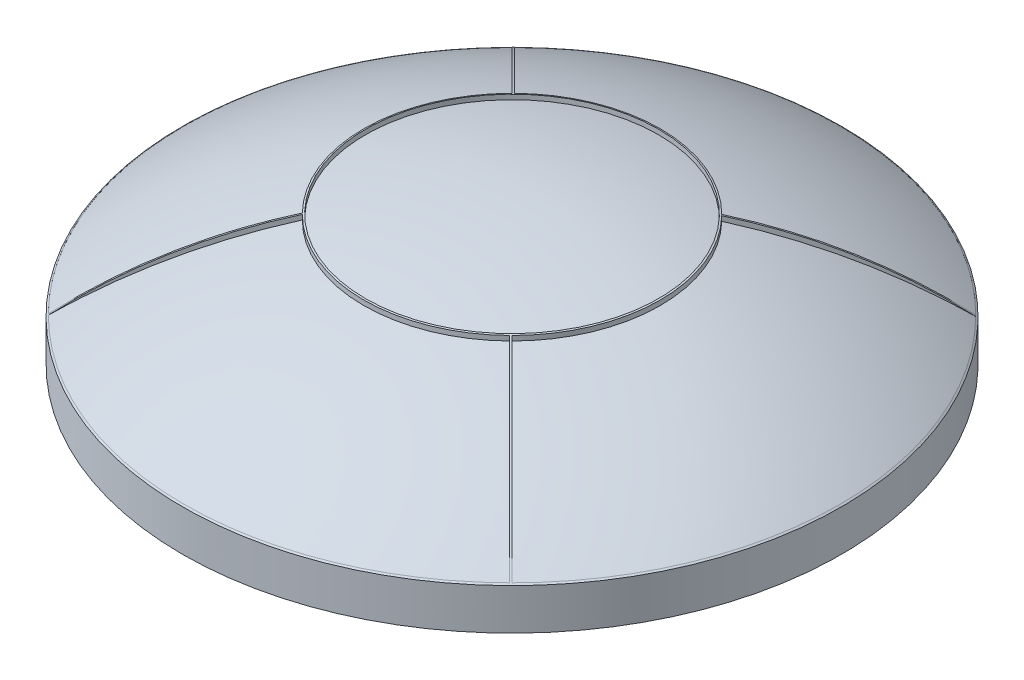
ISO-10303-21;
HEADER;
FILE_DESCRIPTION(('STEP AP214'),'2;1');
FILE_NAME('part.step','',(''),(''),'','','');
FILE_SCHEMA(('AUTOMOTIVE_DESIGN { 1 0 10303 214 1 1 1 1 }'));
ENDSEC;
DATA;
#1=APPLICATION_CONTEXT('core data for automotive mechanical design processes');
#2=APPLICATION_PROTOCOL_DEFINITION('international standard','automotive_design',2000,#1);
#3=PRODUCT_CONTEXT('',#1,'mechanical');
#4=PRODUCT('Part','Part','',(#3));
#5=PRODUCT_RELATED_PRODUCT_CATEGORY('part','',(#4));
#6=PRODUCT_DEFINITION_FORMATION('','',#4);
#7=PRODUCT_DEFINITION_CONTEXT('part definition',#1,'design');
#8=PRODUCT_DEFINITION('design','',#6,#7);
#9=PRODUCT_DEFINITION_SHAPE('','',#8);
#10=(LENGTH_UNIT() NAMED_UNIT(*) SI_UNIT(.MILLI.,.METRE.));
#11=(NAMED_UNIT(*) PLANE_ANGLE_UNIT() SI_UNIT($,.RADIAN.));
#12=(NAMED_UNIT(*) SI_UNIT($,.STERADIAN.) SOLID_ANGLE_UNIT());
#13=UNCERTAINTY_MEASURE_WITH_UNIT(LENGTH_MEASURE(1.E-05),#10,'distance_accuracy_value','');
#14=(GEOMETRIC_REPRESENTATION_CONTEXT(3) GLOBAL_UNCERTAINTY_ASSIGNED_CONTEXT((#13)) GLOBAL_UNIT_ASSIGNED_CONTEXT((#10,
#11,#12)) REPRESENTATION_CONTEXT('',''));
#15=CARTESIAN_POINT('',(0.,0.,0.));
#16=DIRECTION('',(0.,0.,1.));
#17=DIRECTION('',(1.,0.,0.));
#18=AXIS2_PLACEMENT_3D('',#15,#16,#17);
#19=CARTESIAN_POINT('',(0.,0.5,0.));
#20=DIRECTION('',(0.,-1.,0.));
#21=DIRECTION('',(0.,0.,-1.));
#22=AXIS2_PLACEMENT_3D('',#19,#20,#21);
#23=CYLINDRICAL_SURFACE('',#22,4.);
#24=CARTESIAN_POINT('',(0.,0.,0.));
#25=DIRECTION('',(0.,1.,0.));
#26=DIRECTION('',(0.,0.,1.));
#27=AXIS2_PLACEMENT_3D('',#24,#25,#26);
#28=CIRCLE('',#27,4.);
#29=CARTESIAN_POINT('',(0.,0.,4.));
#30=VERTEX_POINT('',#29);
#31=EDGE_CURVE('E234',#30,#30,#28,.T.);
#32=ORIENTED_EDGE('',*,*,#31,.T.);
#33=EDGE_LOOP('',(#32));
#34=FACE_BOUND('',#33,.T.);
#35=CARTESIAN_POINT('',(0.,0.5,0.));
#36=DIRECTION('',(0.,-1.,0.));
#37=DIRECTION('',(0.,0.,-1.));
#38=AXIS2_PLACEMENT_3D('',#35,#36,#37);
#39=CIRCLE('',#38,4.);
#40=CARTESIAN_POINT('',(0.,0.5,-4.));
#41=VERTEX_POINT('',#40);
#42=EDGE_CURVE('E174',#41,#41,#39,.T.);
#43=ORIENTED_EDGE('',*,*,#42,.T.);
#44=EDGE_LOOP('',(#43));
#45=FACE_BOUND('',#44,.T.);
#46=ADVANCED_FACE('F44',(#34,#45),#23,.T.);
#47=CARTESIAN_POINT('',(0.,0.,0.));
#48=DIRECTION('',(0.,1.,0.));
#49=DIRECTION('',(0.,0.,1.));
#50=AXIS2_PLACEMENT_3D('',#47,#48,#49);
#51=PLANE('',#50);
#52=ORIENTED_EDGE('',*,*,#31,.F.);
#53=EDGE_LOOP('',(#52));
#54=FACE_BOUND('',#53,.T.);
#55=CARTESIAN_POINT('',(0.,0.,0.));
#56=DIRECTION('',(0.,1.,0.));
#57=DIRECTION('',(0.,0.,1.));
#58=AXIS2_PLACEMENT_3D('',#55,#56,#57);
#59=CIRCLE('',#58,3.9);
#60=CARTESIAN_POINT('',(0.,0.,3.9));
#61=VERTEX_POINT('',#60);
#62=EDGE_CURVE('E229',#61,#61,#59,.T.);
#63=ORIENTED_EDGE('',*,*,#62,.T.);
#64=EDGE_LOOP('',(#63));
#65=FACE_BOUND('',#64,.T.);
#66=ADVANCED_FACE('F377',(#54,#65),#51,.F.);
#67=CARTESIAN_POINT('',(0.,0.5,0.));
#68=DIRECTION('',(0.,-1.,0.));
#69=DIRECTION('',(0.,0.,-1.));
#70=AXIS2_PLACEMENT_3D('',#67,#68,#69);
#71=CYLINDRICAL_SURFACE('',#70,3.9);
#72=CARTESIAN_POINT('',(0.,0.447379312838322,0.));
#73=DIRECTION('',(0.,-1.,0.));
#74=DIRECTION('',(0.,0.,-1.));
#75=AXIS2_PLACEMENT_3D('',#72,#73,#74);
#76=CIRCLE('',#75,3.9);
#77=CARTESIAN_POINT('',(0.,0.447379312838322,-3.9));
#78=VERTEX_POINT('',#77);
#79=EDGE_CURVE('E231',#78,#78,#76,.F.);
#80=ORIENTED_EDGE('',*,*,#79,.T.);
#81=EDGE_LOOP('',(#80));
#82=FACE_BOUND('',#81,.T.);
#83=ORIENTED_EDGE('',*,*,#62,.F.);
#84=EDGE_LOOP('',(#83));
#85=FACE_BOUND('',#84,.T.);
#86=ADVANCED_FACE('F382',(#82,#85),#71,.F.);
#87=CARTESIAN_POINT('',(0.,-5.27500000000001,0.));
#88=DIRECTION('',(0.,0.,1.));
#89=DIRECTION('',(1.,0.,0.));
#90=AXIS2_PLACEMENT_3D('',#87,#88,#89);
#91=SPHERICAL_SURFACE('',#90,6.92500000000001);
#92=CARTESIAN_POINT('',(0.,-5.27500000000001,0.));
#93=DIRECTION('',(0.,-1.,0.));
#94=DIRECTION('',(0.,0.,-1.));
#95=AXIS2_PLACEMENT_3D('',#92,#93,#94);
#96=SPHERICAL_SURFACE('',#95,6.92500000000001);
#97=ORIENTED_EDGE('',*,*,#79,.F.);
#98=EDGE_LOOP('',(#97));
#99=FACE_BOUND('',#98,.T.);
#100=ADVANCED_FACE('F317',(#99),#96,.F.);
#101=CARTESIAN_POINT('',(0.,-4.24129788820105,0.));
#102=DIRECTION('',(0.,-1.,0.));
#103=DIRECTION('',(0.,0.,-1.));
#104=AXIS2_PLACEMENT_3D('',#101,#102,#103);
#105=DEGENERATE_TOROIDAL_SURFACE('',#104,0.323031909937175,6.,.T.);
#106=CARTESIAN_POINT('',(0.,1.57911824679641,0.));
#107=DIRECTION('',(0.,-1.,0.));
#108=DIRECTION('',(0.,0.,-1.));
#109=AXIS2_PLACEMENT_3D('',#106,#107,#108);
#110=CIRCLE('',#109,1.78);
#111=CARTESIAN_POINT('',(0.,1.57911824679641,-1.78));
#112=VERTEX_POINT('',#111);
#113=EDGE_CURVE('E180',#112,#112,#110,.F.);
#114=ORIENTED_EDGE('',*,*,#113,.F.);
#115=EDGE_LOOP('',(#114));
#116=FACE_BOUND('',#115,.T.);
#117=CARTESIAN_POINT('',(0.,0.515443053689969,0.));
#118=DIRECTION('',(0.,-1.,0.));
#119=DIRECTION('',(0.,0.,-1.));
#120=AXIS2_PLACEMENT_3D('',#117,#118,#119);
#121=CIRCLE('',#120,3.98);
#122=CARTESIAN_POINT('',(2.81428498912247,0.515443053689969,2.81428498912245));
#123=VERTEX_POINT('',#122);
#124=CARTESIAN_POINT('',(2.82839159151781,0.515443053689969,-2.80010732027031));
#125=VERTEX_POINT('',#124);
#126=EDGE_CURVE('E62',#123,#125,#121,.F.);
#127=ORIENTED_EDGE('',*,*,#126,.F.);
#128=CARTESIAN_POINT('',(0.22841805405622,-4.24129788820105,0.228418054056217));
#129=DIRECTION('',(-0.707106781186544,0.,0.707106781186551));
#130=DIRECTION('',(0.707106781186551,0.,0.707106781186544));
#131=AXIS2_PLACEMENT_3D('',#128,#129,#130);
#132=CIRCLE('',#131,6.);
#133=CARTESIAN_POINT('',(1.27279220613579,1.57407529508961,1.27279220613578));
#134=VERTEX_POINT('',#133);
#135=EDGE_CURVE('E308',#123,#134,#132,.T.);
#136=ORIENTED_EDGE('',*,*,#135,.T.);
#137=CARTESIAN_POINT('',(0.,1.57407529508962,0.));
#138=DIRECTION('',(0.,-1.,0.));
#139=DIRECTION('',(0.,0.,-1.));
#140=AXIS2_PLACEMENT_3D('',#137,#138,#139);
#141=CIRCLE('',#140,1.8);
#142=CARTESIAN_POINT('',(1.28685577191432,1.57407529508962,-1.25857150066685));
#143=VERTEX_POINT('',#142);
#144=EDGE_CURVE('E412',#134,#143,#141,.F.);
#145=ORIENTED_EDGE('',*,*,#144,.T.);
#146=CARTESIAN_POINT('',(2.82859159151728,0.51522559443195,-2.80030732026979));
#147=CARTESIAN_POINT('',(2.73325329448407,0.61891786287853,-2.70496902323658));
#148=CARTESIAN_POINT('',(2.63478016523756,0.716846815742468,-2.60649589399008));
#149=CARTESIAN_POINT('',(2.43228250689038,0.900565065052887,-2.40399823564289));
#150=CARTESIAN_POINT('',(2.32825627523377,0.986350608604001,-2.29997200398628));
#151=CARTESIAN_POINT('',(2.11721718036869,1.14377145291902,-2.08893290912121));
#152=CARTESIAN_POINT('',(2.01028379459139,1.21562016420845,-1.98199952334391));
#153=CARTESIAN_POINT('',(1.79257627457968,1.34641172920624,-1.7642920033322));
#154=CARTESIAN_POINT('',(1.68180382015959,1.40536014697418,-1.65351954891212));
#155=CARTESIAN_POINT('',(1.52285605130399,1.47938197423813,-1.49457178005652));
#156=CARTESIAN_POINT('',(1.47593395622236,1.49996232703865,-1.44764968497489));
#157=CARTESIAN_POINT('',(1.38163145832746,1.53879891098853,-1.35334718707999));
#158=CARTESIAN_POINT('',(1.33425124445468,1.55705605969352,-1.3059669732072));
#159=CARTESIAN_POINT('',(1.28665577191432,1.57414711873385,-1.25837150066685));
#160=B_SPLINE_CURVE_WITH_KNOTS('',3,(#146,#147,#148,#149,#150,#151,#152,#153,#154,#155,#156,
#157,#158,#159),.UNSPECIFIED.,.F.,.F.,(4,2,2,2,2,2,4),(0.,0.510122620869838,1.02040255148244,
1.52211437286255,2.02360937122764,2.23200364459259,2.44031535492556),.UNSPECIFIED.);
#161=EDGE_CURVE('E185',#125,#143,#160,.T.);
#162=ORIENTED_EDGE('',*,*,#161,.F.);
#163=EDGE_LOOP('',(#127,#136,#145,#162));
#164=FACE_BOUND('',#163,.T.);
#165=CARTESIAN_POINT('',(0.,0.515443053689969,0.));
#166=DIRECTION('',(0.,-1.,0.));
#167=DIRECTION('',(0.,0.,-1.));
#168=AXIS2_PLACEMENT_3D('',#165,#166,#167);
#169=CIRCLE('',#168,3.98);
#170=CARTESIAN_POINT('',(-2.81428498912247,0.51544305368997,2.81428498912244));
#171=VERTEX_POINT('',#170);
#172=CARTESIAN_POINT('',(2.80010732027034,0.515443053689969,2.82839159151778));
#173=VERTEX_POINT('',#172);
#174=EDGE_CURVE('E297',#171,#173,#169,.F.);
#175=ORIENTED_EDGE('',*,*,#174,.F.);
#176=CARTESIAN_POINT('',(-0.22841805405622,-4.24129788820105,0.228418054056217));
#177=DIRECTION('',(-0.707106781186544,0.,-0.707106781186551));
#178=DIRECTION('',(-0.707106781186551,0.,0.707106781186544));
#179=AXIS2_PLACEMENT_3D('',#176,#177,#178);
#180=CIRCLE('',#179,6.);
#181=CARTESIAN_POINT('',(-1.27279220613579,1.57407529508961,1.27279220613578));
#182=VERTEX_POINT('',#181);
#183=EDGE_CURVE('E287',#171,#182,#180,.T.);
#184=ORIENTED_EDGE('',*,*,#183,.T.);
#185=CARTESIAN_POINT('',(0.,1.57407529508962,0.));
#186=DIRECTION('',(0.,-1.,0.));
#187=DIRECTION('',(0.,0.,-1.));
#188=AXIS2_PLACEMENT_3D('',#185,#186,#187);
#189=CIRCLE('',#188,1.8);
#190=CARTESIAN_POINT('',(1.25857150066686,1.57407529508962,1.28685577191431));
#191=VERTEX_POINT('',#190);
#192=EDGE_CURVE('E290',#182,#191,#189,.F.);
#193=ORIENTED_EDGE('',*,*,#192,.T.);
#194=CARTESIAN_POINT('',(2.80030732026982,0.515225594431952,2.82859159151725));
#195=CARTESIAN_POINT('',(2.70496902323661,0.618917862878531,2.73325329448404));
#196=CARTESIAN_POINT('',(2.6064958939901,0.716846815742469,2.63478016523754));
#197=CARTESIAN_POINT('',(2.40399823564292,0.900565065052888,2.43228250689035));
#198=CARTESIAN_POINT('',(2.2999720039863,0.986350608604002,2.32825627523374));
#199=CARTESIAN_POINT('',(2.08893290912123,1.14377145291902,2.11721718036867));
#200=CARTESIAN_POINT('',(1.98199952334393,1.21562016420846,2.01028379459137));
#201=CARTESIAN_POINT('',(1.76429200333221,1.34641172920624,1.79257627457966));
#202=CARTESIAN_POINT('',(1.65351954891213,1.40536014697418,1.68180382015957));
#203=CARTESIAN_POINT('',(1.49457178005653,1.47938197423813,1.52285605130398));
#204=CARTESIAN_POINT('',(1.4476496849749,1.49996232703865,1.47593395622235));
#205=CARTESIAN_POINT('',(1.35334718708,1.53879891098853,1.38163145832745));
#206=CARTESIAN_POINT('',(1.30596697320722,1.55705605969352,1.33425124445466));
#207=CARTESIAN_POINT('',(1.25837150066686,1.57414711873385,1.28665577191431));
#208=B_SPLINE_CURVE_WITH_KNOTS('',3,(#194,#195,#196,#197,#198,#199,#200,#201,#202,#203,#204,
#205,#206,#207),.UNSPECIFIED.,.F.,.F.,(4,2,2,2,2,2,4),(0.,0.510122620869838,1.02040255148244,
1.52211437286255,2.02360937122765,2.23200364459259,2.44031535492555),.UNSPECIFIED.);
#209=EDGE_CURVE('E300',#173,#191,#208,.T.);
#210=ORIENTED_EDGE('',*,*,#209,.F.);
#211=EDGE_LOOP('',(#175,#184,#193,#210));
#212=FACE_BOUND('',#211,.T.);
#213=ORIENTED_EDGE('',*,*,#42,.F.);
#214=EDGE_LOOP('',(#213));
#215=FACE_BOUND('',#214,.T.);
#216=CARTESIAN_POINT('',(0.,0.515443053689969,0.));
#217=DIRECTION('',(0.,-1.,0.));
#218=DIRECTION('',(0.,0.,-1.));
#219=AXIS2_PLACEMENT_3D('',#216,#217,#218);
#220=CIRCLE('',#219,3.98);
#221=CARTESIAN_POINT('',(-2.81428498912248,0.515443053689969,-2.81428498912244));
#222=VERTEX_POINT('',#221);
#223=CARTESIAN_POINT('',(-2.82839159151781,0.515443053689969,2.80010732027031));
#224=VERTEX_POINT('',#223);
#225=EDGE_CURVE('E161',#222,#224,#220,.F.);
#226=ORIENTED_EDGE('',*,*,#225,.F.);
#227=CARTESIAN_POINT('',(-0.22841805405622,-4.24129788820105,-0.228418054056217));
#228=DIRECTION('',(0.707106781186543,0.,-0.707106781186552));
#229=DIRECTION('',(-0.707106781186552,0.,-0.707106781186543));
#230=AXIS2_PLACEMENT_3D('',#227,#228,#229);
#231=CIRCLE('',#230,6.);
#232=CARTESIAN_POINT('',(-1.27279220613579,1.57407529508961,-1.27279220613578));
#233=VERTEX_POINT('',#232);
#234=EDGE_CURVE('E13',#222,#233,#231,.T.);
#235=ORIENTED_EDGE('',*,*,#234,.T.);
#236=CARTESIAN_POINT('',(0.,1.57407529508962,0.));
#237=DIRECTION('',(0.,-1.,0.));
#238=DIRECTION('',(0.,0.,-1.));
#239=AXIS2_PLACEMENT_3D('',#236,#237,#238);
#240=CIRCLE('',#239,1.8);
#241=CARTESIAN_POINT('',(-1.28685577191432,1.57407529508962,1.25857150066685));
#242=VERTEX_POINT('',#241);
#243=EDGE_CURVE('E158',#233,#242,#240,.F.);
#244=ORIENTED_EDGE('',*,*,#243,.T.);
#245=CARTESIAN_POINT('',(-2.82859159151728,0.51522559443195,2.80030732026979));
#246=CARTESIAN_POINT('',(-2.73325329448407,0.618917862878529,2.70496902323658));
#247=CARTESIAN_POINT('',(-2.63478016523757,0.716846815742467,2.60649589399008));
#248=CARTESIAN_POINT('',(-2.43228250689038,0.900565065052886,2.40399823564289));
#249=CARTESIAN_POINT('',(-2.32825627523377,0.986350608604,2.29997200398628));
#250=CARTESIAN_POINT('',(-2.1172171803687,1.14377145291902,2.08893290912121));
#251=CARTESIAN_POINT('',(-2.01028379459139,1.21562016420845,1.98199952334391));
#252=CARTESIAN_POINT('',(-1.79257627457968,1.34641172920624,1.7642920033322));
#253=CARTESIAN_POINT('',(-1.68180382015959,1.40536014697418,1.65351954891211));
#254=CARTESIAN_POINT('',(-1.52285605130399,1.47938197423813,1.49457178005651));
#255=CARTESIAN_POINT('',(-1.47593395622236,1.49996232703865,1.44764968497488));
#256=CARTESIAN_POINT('',(-1.38163145832746,1.53879891098853,1.35334718707998));
#257=CARTESIAN_POINT('',(-1.33425124445468,1.55705605969352,1.3059669732072));
#258=CARTESIAN_POINT('',(-1.28665577191432,1.57414711873385,1.25837150066684));
#259=B_SPLINE_CURVE_WITH_KNOTS('',3,(#245,#246,#247,#248,#249,#250,#251,#252,#253,#254,#255,
#256,#257,#258),.UNSPECIFIED.,.F.,.F.,(4,2,2,2,2,2,4),(0.,0.510122620869838,1.02040255148244,
1.52211437286255,2.02360937122764,2.23200364459259,2.44031535492556),.UNSPECIFIED.);
#260=EDGE_CURVE('E325',#224,#242,#259,.T.);
#261=ORIENTED_EDGE('',*,*,#260,.F.);
#262=EDGE_LOOP('',(#226,#235,#244,#261));
#263=FACE_BOUND('',#262,.T.);
#264=CARTESIAN_POINT('',(0.22841805405622,-4.24129788820105,-0.228418054056217));
#265=DIRECTION('',(0.707106781186544,0.,0.707106781186551));
#266=DIRECTION('',(0.707106781186551,0.,-0.707106781186544));
#267=AXIS2_PLACEMENT_3D('',#264,#265,#266);
#268=CIRCLE('',#267,6.);
#269=CARTESIAN_POINT('',(2.81428498912248,0.515443053689969,-2.81428498912245));
#270=VERTEX_POINT('',#269);
#271=CARTESIAN_POINT('',(1.27279220613579,1.57407529508962,-1.27279220613578));
#272=VERTEX_POINT('',#271);
#273=EDGE_CURVE('E285',#270,#272,#268,.T.);
#274=ORIENTED_EDGE('',*,*,#273,.T.);
#275=CARTESIAN_POINT('',(0.,1.57407529508962,0.));
#276=DIRECTION('',(0.,-1.,0.));
#277=DIRECTION('',(0.,0.,-1.));
#278=AXIS2_PLACEMENT_3D('',#275,#276,#277);
#279=CIRCLE('',#278,1.8);
#280=CARTESIAN_POINT('',(-1.25857150066686,1.57407529509593,-1.28685577191431));
#281=VERTEX_POINT('',#280);
#282=EDGE_CURVE('E292',#272,#281,#279,.F.);
#283=ORIENTED_EDGE('',*,*,#282,.T.);
#284=CARTESIAN_POINT('',(-2.80030732026982,0.515225594431952,-2.82859159151725));
#285=CARTESIAN_POINT('',(-2.70496902323661,0.618917862878531,-2.73325329448404));
#286=CARTESIAN_POINT('',(-2.6064958939901,0.716846815742469,-2.63478016523754));
#287=CARTESIAN_POINT('',(-2.40399823564292,0.900565065052887,-2.43228250689035));
#288=CARTESIAN_POINT('',(-2.2999720039863,0.986350608604001,-2.32825627523374));
#289=CARTESIAN_POINT('',(-2.08893290912123,1.14377145291902,-2.11721718036867));
#290=CARTESIAN_POINT('',(-1.98199952334393,1.21562016420845,-2.01028379459137));
#291=CARTESIAN_POINT('',(-1.76429200333221,1.34641172920624,-1.79257627457966));
#292=CARTESIAN_POINT('',(-1.65351954891213,1.40536014697418,-1.68180382015957));
#293=CARTESIAN_POINT('',(-1.49457178005653,1.47938197423813,-1.52285605130398));
#294=CARTESIAN_POINT('',(-1.4476496849749,1.49996232703865,-1.47593395622235));
#295=CARTESIAN_POINT('',(-1.35334718708,1.53879891098853,-1.38163145832745));
#296=CARTESIAN_POINT('',(-1.30596697320722,1.55705605969352,-1.33425124445466));
#297=CARTESIAN_POINT('',(-1.25837150066686,1.57414711873385,-1.28665577191431));
#298=B_SPLINE_CURVE_WITH_KNOTS('',3,(#284,#285,#286,#287,#288,#289,#290,#291,#292,#293,#294,
#295,#296,#297),.UNSPECIFIED.,.F.,.F.,(4,2,2,2,2,2,4),(0.,0.510122620869838,1.02040255148243,
1.52211437286255,2.02360937122764,2.23200364459259,2.44031535492555),.UNSPECIFIED.);
#299=CARTESIAN_POINT('',(-2.80010732027033,0.515443053689987,-2.82839159151776));
#300=VERTEX_POINT('',#299);
#301=EDGE_CURVE('E333',#300,#281,#298,.T.);
#302=ORIENTED_EDGE('',*,*,#301,.F.);
#303=CARTESIAN_POINT('',(0.,0.515443053689969,0.));
#304=DIRECTION('',(0.,-1.,0.));
#305=DIRECTION('',(0.,0.,-1.));
#306=AXIS2_PLACEMENT_3D('',#303,#304,#305);
#307=CIRCLE('',#306,3.98);
#308=EDGE_CURVE('E288',#270,#300,#307,.F.);
#309=ORIENTED_EDGE('',*,*,#308,.F.);
#310=EDGE_LOOP('',(#274,#283,#302,#309));
#311=FACE_BOUND('',#310,.T.);
#312=ADVANCED_FACE('F156',(#116,#164,#212,#215,#263,#311),#105,.T.);
#313=CARTESIAN_POINT('',(0.,-5.27500000000001,0.));
#314=DIRECTION('',(0.,0.,1.));
#315=DIRECTION('',(1.,0.,0.));
#316=AXIS2_PLACEMENT_3D('',#313,#314,#315);
#317=SPHERICAL_SURFACE('',#316,7.02500000000001);
#318=CARTESIAN_POINT('',(0.,0.513801689469074,0.));
#319=DIRECTION('',(0.,-1.,0.));
#320=DIRECTION('',(0.,0.,-1.));
#321=AXIS2_PLACEMENT_3D('',#318,#319,#320);
#322=CIRCLE('',#321,3.98);
#323=CARTESIAN_POINT('',(-2.80010732027034,0.513801689469074,-2.82839159151778));
#324=VERTEX_POINT('',#323);
#325=CARTESIAN_POINT('',(2.81428498912248,0.513801689469075,-2.81428498912245));
#326=VERTEX_POINT('',#325);
#327=EDGE_CURVE('E242',#324,#326,#322,.T.);
#328=ORIENTED_EDGE('',*,*,#327,.F.);
#329=CARTESIAN_POINT('',(0.0141421356237311,-5.27500000000001,-0.0141421356237312));
#330=DIRECTION('',(0.707106781186543,0.,-0.707106781186552));
#331=DIRECTION('',(-0.707106781186552,0.,-0.707106781186543));
#332=AXIS2_PLACEMENT_3D('',#329,#330,#331);
#333=CIRCLE('',#332,7.02497153019143);
#334=CARTESIAN_POINT('',(-1.25857150066686,1.51548046900954,-1.28685577191431));
#335=VERTEX_POINT('',#334);
#336=EDGE_CURVE('E52',#335,#324,#333,.F.);
#337=ORIENTED_EDGE('',*,*,#336,.F.);
#338=CARTESIAN_POINT('',(0.,1.51548046900954,0.));
#339=DIRECTION('',(0.,-1.,0.));
#340=DIRECTION('',(0.,0.,-1.));
#341=AXIS2_PLACEMENT_3D('',#338,#339,#340);
#342=CIRCLE('',#341,1.8);
#343=CARTESIAN_POINT('',(1.27279220613579,1.51548046900954,-1.27279220613578));
#344=VERTEX_POINT('',#343);
#345=EDGE_CURVE('E225',#335,#344,#342,.T.);
#346=ORIENTED_EDGE('',*,*,#345,.T.);
#347=CARTESIAN_POINT('',(0.,-5.27500000000001,0.));
#348=DIRECTION('',(0.707106781186544,0.,0.707106781186551));
#349=DIRECTION('',(0.707106781186551,0.,-0.707106781186544));
#350=AXIS2_PLACEMENT_3D('',#347,#348,#349);
#351=CIRCLE('',#350,7.02500000000001);
#352=EDGE_CURVE('E245',#344,#326,#351,.F.);
#353=ORIENTED_EDGE('',*,*,#352,.T.);
#354=EDGE_LOOP('',(#328,#337,#346,#353));
#355=FACE_BOUND('',#354,.T.);
#356=ADVANCED_FACE('F279',(#355),#317,.T.);
#357=CARTESIAN_POINT('',(-1.25865007051206,2.25,-1.28693434175951));
#358=DIRECTION('',(0.707106781186543,0.,-0.707106781186552));
#359=DIRECTION('',(-0.707106781186552,0.,-0.707106781186543));
#360=AXIS2_PLACEMENT_3D('',#357,#358,#359);
#361=PLANE('',#360);
#362=DIRECTION('',(0.,-1.,0.));
#363=VECTOR('',#362,1.);
#364=CARTESIAN_POINT('',(-2.80010732027034,2.25,-2.82839159151777));
#365=LINE('',#364,#363);
#366=EDGE_CURVE('E191',#324,#300,#365,.F.);
#367=ORIENTED_EDGE('',*,*,#366,.T.);
#368=ORIENTED_EDGE('',*,*,#301,.T.);
#369=DIRECTION('',(0.,-1.,0.));
#370=VECTOR('',#369,1.);
#371=CARTESIAN_POINT('',(-1.25857150066686,2.25,-1.28685577191431));
#372=LINE('',#371,#370);
#373=EDGE_CURVE('E182',#335,#281,#372,.F.);
#374=ORIENTED_EDGE('',*,*,#373,.F.);
#375=ORIENTED_EDGE('',*,*,#336,.T.);
#376=EDGE_LOOP('',(#367,#368,#374,#375));
#377=FACE_BOUND('',#376,.T.);
#378=ADVANCED_FACE('F319',(#377),#361,.T.);
#379=CARTESIAN_POINT('',(2.82842712474621,2.25,-2.82842712474618));
#380=DIRECTION('',(0.707106781186544,0.,0.707106781186551));
#381=DIRECTION('',(0.707106781186551,0.,-0.707106781186544));
#382=AXIS2_PLACEMENT_3D('',#379,#380,#381);
#383=PLANE('',#382);
#384=ORIENTED_EDGE('',*,*,#273,.F.);
#385=DIRECTION('',(0.,-1.,0.));
#386=VECTOR('',#385,1.);
#387=CARTESIAN_POINT('',(2.81428498912248,2.25,-2.81428498912245));
#388=LINE('',#387,#386);
#389=EDGE_CURVE('E216',#326,#270,#388,.F.);
#390=ORIENTED_EDGE('',*,*,#389,.F.);
#391=ORIENTED_EDGE('',*,*,#352,.F.);
#392=DIRECTION('',(0.,-1.,0.));
#393=VECTOR('',#392,1.);
#394=CARTESIAN_POINT('',(1.27279220613579,2.25,-1.27279220613578));
#395=LINE('',#394,#393);
#396=EDGE_CURVE('E214',#272,#344,#395,.T.);
#397=ORIENTED_EDGE('',*,*,#396,.F.);
#398=EDGE_LOOP('',(#384,#390,#391,#397));
#399=FACE_BOUND('',#398,.T.);
#400=ADVANCED_FACE('F284',(#399),#383,.F.);
#401=CARTESIAN_POINT('',(0.,2.25,0.));
#402=DIRECTION('',(0.,-1.,0.));
#403=DIRECTION('',(0.,0.,-1.));
#404=AXIS2_PLACEMENT_3D('',#401,#402,#403);
#405=CYLINDRICAL_SURFACE('',#404,1.8);
#406=ORIENTED_EDGE('',*,*,#282,.F.);
#407=ORIENTED_EDGE('',*,*,#396,.T.);
#408=ORIENTED_EDGE('',*,*,#345,.F.);
#409=ORIENTED_EDGE('',*,*,#373,.T.);
#410=EDGE_LOOP('',(#406,#407,#408,#409));
#411=FACE_BOUND('',#410,.T.);
#412=ADVANCED_FACE('F341',(#411),#405,.T.);
#413=CARTESIAN_POINT('',(0.,2.25,0.));
#414=DIRECTION('',(0.,-1.,0.));
#415=DIRECTION('',(0.,0.,-1.));
#416=AXIS2_PLACEMENT_3D('',#413,#414,#415);
#417=CYLINDRICAL_SURFACE('',#416,3.98);
#418=ORIENTED_EDGE('',*,*,#389,.T.);
#419=ORIENTED_EDGE('',*,*,#308,.T.);
#420=ORIENTED_EDGE('',*,*,#366,.F.);
#421=ORIENTED_EDGE('',*,*,#327,.T.);
#422=EDGE_LOOP('',(#418,#419,#420,#421));
#423=FACE_BOUND('',#422,.T.);
#424=ADVANCED_FACE('F273',(#423),#417,.F.);
#425=CARTESIAN_POINT('',(1.25857150066686,1.51548046900954,1.28685577191431));
#426=VERTEX_POINT('',#425);
#427=CARTESIAN_POINT('',(-1.27279220613579,1.51548046900954,1.27279220613578));
#428=VERTEX_POINT('',#427);
#429=EDGE_CURVE('E230',#426,#428,#342,.T.);
#430=ORIENTED_EDGE('',*,*,#429,.T.);
#431=CARTESIAN_POINT('',(0.,-5.27500000000001,0.));
#432=DIRECTION('',(-0.707106781186544,0.,-0.707106781186551));
#433=DIRECTION('',(-0.707106781186551,0.,0.707106781186544));
#434=AXIS2_PLACEMENT_3D('',#431,#432,#433);
#435=CIRCLE('',#434,7.02500000000001);
#436=CARTESIAN_POINT('',(-2.81428498912248,0.513801689469075,2.81428498912245));
#437=VERTEX_POINT('',#436);
#438=EDGE_CURVE('E254',#428,#437,#435,.F.);
#439=ORIENTED_EDGE('',*,*,#438,.T.);
#440=CARTESIAN_POINT('',(2.80010732027034,0.513801689469074,2.82839159151778));
#441=VERTEX_POINT('',#440);
#442=EDGE_CURVE('E246',#441,#437,#322,.T.);
#443=ORIENTED_EDGE('',*,*,#442,.F.);
#444=CARTESIAN_POINT('',(-0.0141421356237305,-5.27500000000001,0.0141421356237307));
#445=DIRECTION('',(-0.707106781186544,0.,0.707106781186551));
#446=DIRECTION('',(0.707106781186551,0.,0.707106781186544));
#447=AXIS2_PLACEMENT_3D('',#444,#445,#446);
#448=CIRCLE('',#447,7.02497153019143);
#449=EDGE_CURVE('E252',#426,#441,#448,.F.);
#450=ORIENTED_EDGE('',*,*,#449,.F.);
#451=EDGE_LOOP('',(#430,#439,#443,#450));
#452=FACE_BOUND('',#451,.T.);
#453=ADVANCED_FACE('F346',(#452),#317,.T.);
#454=CARTESIAN_POINT('',(1.25865007051206,2.25,1.28693434175951));
#455=DIRECTION('',(-0.707106781186544,0.,0.707106781186551));
#456=DIRECTION('',(0.707106781186551,0.,0.707106781186544));
#457=AXIS2_PLACEMENT_3D('',#454,#455,#456);
#458=PLANE('',#457);
#459=DIRECTION('',(0.,-1.,0.));
#460=VECTOR('',#459,1.);
#461=CARTESIAN_POINT('',(2.80010732027034,2.25,2.82839159151778));
#462=LINE('',#461,#460);
#463=EDGE_CURVE('E211',#441,#173,#462,.F.);
#464=ORIENTED_EDGE('',*,*,#463,.T.);
#465=ORIENTED_EDGE('',*,*,#209,.T.);
#466=DIRECTION('',(0.,-1.,0.));
#467=VECTOR('',#466,1.);
#468=CARTESIAN_POINT('',(1.25857150066686,2.25,1.28685577191431));
#469=LINE('',#468,#467);
#470=EDGE_CURVE('E208',#426,#191,#469,.F.);
#471=ORIENTED_EDGE('',*,*,#470,.F.);
#472=ORIENTED_EDGE('',*,*,#449,.T.);
#473=EDGE_LOOP('',(#464,#465,#471,#472));
#474=FACE_BOUND('',#473,.T.);
#475=ADVANCED_FACE('F310',(#474),#458,.T.);
#476=CARTESIAN_POINT('',(-2.82842712474621,2.25,2.82842712474618));
#477=DIRECTION('',(-0.707106781186544,0.,-0.707106781186551));
#478=DIRECTION('',(-0.707106781186551,0.,0.707106781186544));
#479=AXIS2_PLACEMENT_3D('',#476,#477,#478);
#480=PLANE('',#479);
#481=ORIENTED_EDGE('',*,*,#183,.F.);
#482=DIRECTION('',(0.,-1.,0.));
#483=VECTOR('',#482,1.);
#484=CARTESIAN_POINT('',(-2.81428498912248,2.25,2.81428498912245));
#485=LINE('',#484,#483);
#486=EDGE_CURVE('E196',#437,#171,#485,.F.);
#487=ORIENTED_EDGE('',*,*,#486,.F.);
#488=ORIENTED_EDGE('',*,*,#438,.F.);
#489=DIRECTION('',(0.,-1.,0.));
#490=VECTOR('',#489,1.);
#491=CARTESIAN_POINT('',(-1.27279220613579,2.25,1.27279220613578));
#492=LINE('',#491,#490);
#493=EDGE_CURVE('E194',#182,#428,#492,.T.);
#494=ORIENTED_EDGE('',*,*,#493,.F.);
#495=EDGE_LOOP('',(#481,#487,#488,#494));
#496=FACE_BOUND('',#495,.T.);
#497=ADVANCED_FACE('F354',(#496),#480,.F.);
#498=ORIENTED_EDGE('',*,*,#192,.F.);
#499=ORIENTED_EDGE('',*,*,#493,.T.);
#500=ORIENTED_EDGE('',*,*,#429,.F.);
#501=ORIENTED_EDGE('',*,*,#470,.T.);
#502=EDGE_LOOP('',(#498,#499,#500,#501));
#503=FACE_BOUND('',#502,.T.);
#504=ADVANCED_FACE('F360',(#503),#405,.T.);
#505=ORIENTED_EDGE('',*,*,#486,.T.);
#506=ORIENTED_EDGE('',*,*,#174,.T.);
#507=ORIENTED_EDGE('',*,*,#463,.F.);
#508=ORIENTED_EDGE('',*,*,#442,.T.);
#509=EDGE_LOOP('',(#505,#506,#507,#508));
#510=FACE_BOUND('',#509,.T.);
#511=ADVANCED_FACE('F356',(#510),#417,.F.);
#512=CARTESIAN_POINT('',(1.28685577191432,1.51548046900954,-1.25857150066685));
#513=VERTEX_POINT('',#512);
#514=CARTESIAN_POINT('',(1.27279220613579,1.51548046900954,1.27279220613578));
#515=VERTEX_POINT('',#514);
#516=EDGE_CURVE('E226',#513,#515,#342,.T.);
#517=ORIENTED_EDGE('',*,*,#516,.T.);
#518=CARTESIAN_POINT('',(0.,-5.27500000000001,0.));
#519=DIRECTION('',(-0.707106781186544,0.,0.707106781186551));
#520=DIRECTION('',(0.707106781186551,0.,0.707106781186544));
#521=AXIS2_PLACEMENT_3D('',#518,#519,#520);
#522=CIRCLE('',#521,7.02500000000001);
#523=CARTESIAN_POINT('',(2.81428498912248,0.513801689469075,2.81428498912245));
#524=VERTEX_POINT('',#523);
#525=EDGE_CURVE('E249',#515,#524,#522,.F.);
#526=ORIENTED_EDGE('',*,*,#525,.T.);
#527=CARTESIAN_POINT('',(2.8283915915178,0.513801689469074,-2.80010732027031));
#528=VERTEX_POINT('',#527);
#529=EDGE_CURVE('E243',#528,#524,#322,.T.);
#530=ORIENTED_EDGE('',*,*,#529,.F.);
#531=CARTESIAN_POINT('',(0.0141421356237319,-5.27500000000001,0.014142135623732));
#532=DIRECTION('',(0.707106781186544,0.,0.707106781186551));
#533=DIRECTION('',(0.707106781186551,0.,-0.707106781186544));
#534=AXIS2_PLACEMENT_3D('',#531,#532,#533);
#535=CIRCLE('',#534,7.02497153019143);
#536=EDGE_CURVE('E247',#513,#528,#535,.F.);
#537=ORIENTED_EDGE('',*,*,#536,.F.);
#538=EDGE_LOOP('',(#517,#526,#530,#537));
#539=FACE_BOUND('',#538,.T.);
#540=ADVANCED_FACE('F405',(#539),#317,.T.);
#541=CARTESIAN_POINT('',(1.28693434175952,2.25,-1.25865007051205));
#542=DIRECTION('',(0.707106781186544,0.,0.707106781186551));
#543=DIRECTION('',(0.707106781186551,0.,-0.707106781186544));
#544=AXIS2_PLACEMENT_3D('',#541,#542,#543);
#545=PLANE('',#544);
#546=DIRECTION('',(0.,-1.,0.));
#547=VECTOR('',#546,1.);
#548=CARTESIAN_POINT('',(2.8283915915178,2.25,-2.80010732027031));
#549=LINE('',#548,#547);
#550=EDGE_CURVE('E222',#528,#125,#549,.F.);
#551=ORIENTED_EDGE('',*,*,#550,.T.);
#552=ORIENTED_EDGE('',*,*,#161,.T.);
#553=DIRECTION('',(0.,-1.,0.));
#554=VECTOR('',#553,1.);
#555=CARTESIAN_POINT('',(1.28685577191432,2.25,-1.25857150066685));
#556=LINE('',#555,#554);
#557=EDGE_CURVE('E219',#513,#143,#556,.F.);
#558=ORIENTED_EDGE('',*,*,#557,.F.);
#559=ORIENTED_EDGE('',*,*,#536,.T.);
#560=EDGE_LOOP('',(#551,#552,#558,#559));
#561=FACE_BOUND('',#560,.T.);
#562=ADVANCED_FACE('F401',(#561),#545,.T.);
#563=CARTESIAN_POINT('',(2.82842712474621,2.25,2.82842712474618));
#564=DIRECTION('',(-0.707106781186544,0.,0.707106781186551));
#565=DIRECTION('',(0.707106781186551,0.,0.707106781186544));
#566=AXIS2_PLACEMENT_3D('',#563,#564,#565);
#567=PLANE('',#566);
#568=ORIENTED_EDGE('',*,*,#135,.F.);
#569=DIRECTION('',(0.,-1.,0.));
#570=VECTOR('',#569,1.);
#571=CARTESIAN_POINT('',(2.81428498912248,2.25,2.81428498912245));
#572=LINE('',#571,#570);
#573=EDGE_CURVE('E205',#524,#123,#572,.F.);
#574=ORIENTED_EDGE('',*,*,#573,.F.);
#575=ORIENTED_EDGE('',*,*,#525,.F.);
#576=DIRECTION('',(0.,-1.,0.));
#577=VECTOR('',#576,1.);
#578=CARTESIAN_POINT('',(1.27279220613579,2.25,1.27279220613578));
#579=LINE('',#578,#577);
#580=EDGE_CURVE('E203',#134,#515,#579,.T.);
#581=ORIENTED_EDGE('',*,*,#580,.F.);
#582=EDGE_LOOP('',(#568,#574,#575,#581));
#583=FACE_BOUND('',#582,.T.);
#584=ADVANCED_FACE('F404',(#583),#567,.F.);
#585=ORIENTED_EDGE('',*,*,#144,.F.);
#586=ORIENTED_EDGE('',*,*,#580,.T.);
#587=ORIENTED_EDGE('',*,*,#516,.F.);
#588=ORIENTED_EDGE('',*,*,#557,.T.);
#589=EDGE_LOOP('',(#585,#586,#587,#588));
#590=FACE_BOUND('',#589,.T.);
#591=ADVANCED_FACE('F418',(#590),#405,.T.);
#592=ORIENTED_EDGE('',*,*,#573,.T.);
#593=ORIENTED_EDGE('',*,*,#126,.T.);
#594=ORIENTED_EDGE('',*,*,#550,.F.);
#595=ORIENTED_EDGE('',*,*,#529,.T.);
#596=EDGE_LOOP('',(#592,#593,#594,#595));
#597=FACE_BOUND('',#596,.T.);
#598=ADVANCED_FACE('F426',(#597),#417,.F.);
#599=CARTESIAN_POINT('',(0.,1.75,0.));
#600=VERTEX_POINT('',#599);
#601=VERTEX_LOOP('',#600);
#602=FACE_BOUND('',#601,.T.);
#603=CARTESIAN_POINT('',(0.,1.52075051042929,0.));
#604=DIRECTION('',(0.,-1.,0.));
#605=DIRECTION('',(0.,0.,-1.));
#606=AXIS2_PLACEMENT_3D('',#603,#604,#605);
#607=CIRCLE('',#606,1.78);
#608=CARTESIAN_POINT('',(0.,1.52075051042929,-1.78));
#609=VERTEX_POINT('',#608);
#610=EDGE_CURVE('E239',#609,#609,#607,.T.);
#611=ORIENTED_EDGE('',*,*,#610,.F.);
#612=EDGE_LOOP('',(#611));
#613=FACE_BOUND('',#612,.T.);
#614=ADVANCED_FACE('F46',(#602,#613),#317,.T.);
#615=CARTESIAN_POINT('',(0.,2.25,0.));
#616=DIRECTION('',(0.,-1.,0.));
#617=DIRECTION('',(0.,0.,-1.));
#618=AXIS2_PLACEMENT_3D('',#615,#616,#617);
#619=CYLINDRICAL_SURFACE('',#618,1.78);
#620=CARTESIAN_POINT('',(0.,1.52075051042929,-1.78));
#621=CARTESIAN_POINT('',(0.,1.52135850768312,-1.78));
#622=CARTESIAN_POINT('',(0.,1.52196650493694,-1.78));
#623=CARTESIAN_POINT('',(0.,1.52318249944459,-1.78));
#624=CARTESIAN_POINT('',(0.,1.52379049669842,-1.78));
#625=CARTESIAN_POINT('',(0.,1.52500649120606,-1.78));
#626=CARTESIAN_POINT('',(0.,1.52561448845989,-1.78));
#627=CARTESIAN_POINT('',(0.,1.52683048296754,-1.78));
#628=CARTESIAN_POINT('',(0.,1.52743848022136,-1.78));
#629=CARTESIAN_POINT('',(0.,1.52865447472901,-1.78));
#630=CARTESIAN_POINT('',(0.,1.52926247198283,-1.78));
#631=CARTESIAN_POINT('',(0.,1.53047846649048,-1.78));
#632=CARTESIAN_POINT('',(0.,1.5310864637443,-1.78));
#633=CARTESIAN_POINT('',(0.,1.53230245825195,-1.78));
#634=CARTESIAN_POINT('',(0.,1.53291045550578,-1.78));
#635=CARTESIAN_POINT('',(0.,1.53412645001342,-1.78));
#636=CARTESIAN_POINT('',(0.,1.53473444726725,-1.78));
#637=CARTESIAN_POINT('',(0.,1.5359504417749,-1.78));
#638=CARTESIAN_POINT('',(0.,1.53655843902872,-1.78));
#639=CARTESIAN_POINT('',(0.,1.53777443353637,-1.78));
#640=CARTESIAN_POINT('',(0.,1.53838243079019,-1.78));
#641=CARTESIAN_POINT('',(0.,1.53959842529784,-1.78));
#642=CARTESIAN_POINT('',(0.,1.54020642255166,-1.78));
#643=CARTESIAN_POINT('',(0.,1.54142241705931,-1.78));
#644=CARTESIAN_POINT('',(0.,1.54203041431314,-1.78));
#645=CARTESIAN_POINT('',(0.,1.54324640882079,-1.78));
#646=CARTESIAN_POINT('',(0.,1.54385440607461,-1.78));
#647=CARTESIAN_POINT('',(0.,1.54507040058226,-1.78));
#648=CARTESIAN_POINT('',(0.,1.54567839783608,-1.78));
#649=CARTESIAN_POINT('',(0.,1.54689439234373,-1.78));
#650=CARTESIAN_POINT('',(0.,1.54750238959755,-1.78));
#651=CARTESIAN_POINT('',(0.,1.5487183841052,-1.78));
#652=CARTESIAN_POINT('',(0.,1.54932638135903,-1.78));
#653=CARTESIAN_POINT('',(0.,1.55054237586667,-1.78));
#654=CARTESIAN_POINT('',(0.,1.5511503731205,-1.78));
#655=CARTESIAN_POINT('',(0.,1.55236636762815,-1.78));
#656=CARTESIAN_POINT('',(0.,1.55297436488197,-1.78));
#657=CARTESIAN_POINT('',(0.,1.55419035938962,-1.78));
#658=CARTESIAN_POINT('',(0.,1.55479835664344,-1.78));
#659=CARTESIAN_POINT('',(0.,1.55601435115109,-1.78));
#660=CARTESIAN_POINT('',(0.,1.55662234840491,-1.78));
#661=CARTESIAN_POINT('',(0.,1.55783834291256,-1.78));
#662=CARTESIAN_POINT('',(0.,1.55844634016639,-1.78));
#663=CARTESIAN_POINT('',(0.,1.55966233467404,-1.78));
#664=CARTESIAN_POINT('',(0.,1.56027033192786,-1.78));
#665=CARTESIAN_POINT('',(0.,1.56148632643551,-1.78));
#666=CARTESIAN_POINT('',(0.,1.56209432368933,-1.78));
#667=CARTESIAN_POINT('',(0.,1.56331031819698,-1.78));
#668=CARTESIAN_POINT('',(0.,1.5639183154508,-1.78));
#669=CARTESIAN_POINT('',(0.,1.56513430995845,-1.78));
#670=CARTESIAN_POINT('',(0.,1.56574230721228,-1.78));
#671=CARTESIAN_POINT('',(0.,1.56695830171992,-1.78));
#672=CARTESIAN_POINT('',(0.,1.56756629897375,-1.78));
#673=CARTESIAN_POINT('',(0.,1.5687822934814,-1.78));
#674=CARTESIAN_POINT('',(0.,1.56939029073522,-1.78));
#675=CARTESIAN_POINT('',(0.,1.57060628524287,-1.78));
#676=CARTESIAN_POINT('',(0.,1.57121428249669,-1.78));
#677=CARTESIAN_POINT('',(0.,1.57243027700434,-1.78));
#678=CARTESIAN_POINT('',(0.,1.57303827425816,-1.78));
#679=CARTESIAN_POINT('',(0.,1.57425426876581,-1.78));
#680=CARTESIAN_POINT('',(0.,1.57486226601964,-1.78));
#681=CARTESIAN_POINT('',(0.,1.57607826052729,-1.78));
#682=CARTESIAN_POINT('',(0.,1.57668625778111,-1.78));
#683=CARTESIAN_POINT('',(0.,1.57790225228876,-1.78));
#684=CARTESIAN_POINT('',(0.,1.57851024954258,-1.78));
#685=CARTESIAN_POINT('',(0.,1.57911824679641,-1.78));
#686=B_SPLINE_CURVE_WITH_KNOTS('',3,(#620,#621,#622,#623,#624,#625,#626,#627,#628,#629,#630,
#631,#632,#633,#634,#635,#636,#637,#638,#639,#640,#641,#642,#643,#644,#645,#646,#647,#648,#649,
#650,#651,#652,#653,#654,#655,#656,#657,#658,#659,#660,#661,#662,#663,#664,#665,#666,#667,#668,
#669,#670,#671,#672,#673,#674,#675,#676,#677,#678,#679,#680,#681,#682,#683,#684,#685),
.UNSPECIFIED.,.F.,.F.,(4,2,2,2,2,2,2,2,2,2,2,2,2,2,2,2,2,2,2,2,2,2,2,2,2,2,2,2,2,2,2,2,4),(0.,
0.00182399176147218,0.00364798352294436,0.00547197528441676,0.00729596704588894,
0.00911995880736112,0.0109439505688335,0.0127679423303057,0.0145919340917779,0.0164159258532501,
0.0182399176147222,0.0200639093761944,0.0218879011376666,0.0237118928991388,0.025535884660611,
0.0273598764220831,0.0291838681835553,0.0310078599450275,0.0328318517064997,0.0346558434679721,
0.0364798352294443,0.0383038269909165,0.0401278187523888,0.041951810513861,0.0437758022753332,
0.0455997940368054,0.0474237857982776,0.0492477775597498,0.0510717693212219,0.0528957610826941,
0.0547197528441663,0.0565437446056385,0.0583677363671107),.UNSPECIFIED.);
#687=EDGE_CURVE('BSEAM374',#609,#112,#686,.T.);
#688=ORIENTED_EDGE('',*,*,#610,.T.);
#689=ORIENTED_EDGE('',*,*,#113,.T.);
#690=ORIENTED_EDGE('',*,*,#687,.T.);
#691=ORIENTED_EDGE('',*,*,#687,.F.);
#692=EDGE_LOOP('',(#688,#690,#689,#691));
#693=FACE_BOUND('',#692,.T.);
#694=ADVANCED_FACE('F374',(#693),#619,.F.);
#695=CARTESIAN_POINT('',(-1.28685577191432,1.51548046900954,1.25857150066684));
#696=VERTEX_POINT('',#695);
#697=CARTESIAN_POINT('',(-1.27279220613579,1.51548046900954,-1.27279220613578));
#698=VERTEX_POINT('',#697);
#699=EDGE_CURVE('E265',#696,#698,#342,.T.);
#700=ORIENTED_EDGE('',*,*,#699,.T.);
#701=CARTESIAN_POINT('',(0.,-5.27500000000001,0.));
#702=DIRECTION('',(0.707106781186543,0.,-0.707106781186552));
#703=DIRECTION('',(-0.707106781186552,0.,-0.707106781186543));
#704=AXIS2_PLACEMENT_3D('',#701,#702,#703);
#705=CIRCLE('',#704,7.02500000000001);
#706=CARTESIAN_POINT('',(-2.81428498912248,0.513801689469075,-2.81428498912245));
#707=VERTEX_POINT('',#706);
#708=EDGE_CURVE('E178',#698,#707,#705,.F.);
#709=ORIENTED_EDGE('',*,*,#708,.T.);
#710=CARTESIAN_POINT('',(-2.82839159151781,0.513801689469075,2.80010732027031));
#711=VERTEX_POINT('',#710);
#712=EDGE_CURVE('E264',#711,#707,#322,.T.);
#713=ORIENTED_EDGE('',*,*,#712,.F.);
#714=CARTESIAN_POINT('',(-0.0141421356237312,-5.27500000000001,-0.0141421356237314));
#715=DIRECTION('',(-0.707106781186544,0.,-0.707106781186551));
#716=DIRECTION('',(-0.707106781186551,0.,0.707106781186544));
#717=AXIS2_PLACEMENT_3D('',#714,#715,#716);
#718=CIRCLE('',#717,7.02497153019143);
#719=EDGE_CURVE('E257',#696,#711,#718,.F.);
#720=ORIENTED_EDGE('',*,*,#719,.F.);
#721=EDGE_LOOP('',(#700,#709,#713,#720));
#722=FACE_BOUND('',#721,.T.);
#723=ADVANCED_FACE('F263',(#722),#317,.T.);
#724=CARTESIAN_POINT('',(-1.28693434175952,2.25,1.25865007051205));
#725=DIRECTION('',(-0.707106781186544,0.,-0.707106781186551));
#726=DIRECTION('',(-0.707106781186551,0.,0.707106781186544));
#727=AXIS2_PLACEMENT_3D('',#724,#725,#726);
#728=PLANE('',#727);
#729=DIRECTION('',(0.,-1.,0.));
#730=VECTOR('',#729,1.);
#731=CARTESIAN_POINT('',(-2.82839159151781,2.25,2.80010732027031));
#732=LINE('',#731,#730);
#733=EDGE_CURVE('E200',#711,#224,#732,.F.);
#734=ORIENTED_EDGE('',*,*,#733,.T.);
#735=ORIENTED_EDGE('',*,*,#260,.T.);
#736=DIRECTION('',(0.,-1.,0.));
#737=VECTOR('',#736,1.);
#738=CARTESIAN_POINT('',(-1.28685577191432,2.25,1.25857150066684));
#739=LINE('',#738,#737);
#740=EDGE_CURVE('E173',#696,#242,#739,.F.);
#741=ORIENTED_EDGE('',*,*,#740,.F.);
#742=ORIENTED_EDGE('',*,*,#719,.T.);
#743=EDGE_LOOP('',(#734,#735,#741,#742));
#744=FACE_BOUND('',#743,.T.);
#745=ADVANCED_FACE('F368',(#744),#728,.T.);
#746=CARTESIAN_POINT('',(-2.82842712474621,2.25,-2.82842712474618));
#747=DIRECTION('',(0.707106781186543,0.,-0.707106781186552));
#748=DIRECTION('',(-0.707106781186552,0.,-0.707106781186543));
#749=AXIS2_PLACEMENT_3D('',#746,#747,#748);
#750=PLANE('',#749);
#751=ORIENTED_EDGE('',*,*,#234,.F.);
#752=DIRECTION('',(0.,-1.,0.));
#753=VECTOR('',#752,1.);
#754=CARTESIAN_POINT('',(-2.81428498912248,2.25,-2.81428498912245));
#755=LINE('',#754,#753);
#756=EDGE_CURVE('E179',#707,#222,#755,.F.);
#757=ORIENTED_EDGE('',*,*,#756,.F.);
#758=ORIENTED_EDGE('',*,*,#708,.F.);
#759=DIRECTION('',(0.,-1.,0.));
#760=VECTOR('',#759,1.);
#761=CARTESIAN_POINT('',(-1.27279220613579,2.25,-1.27279220613578));
#762=LINE('',#761,#760);
#763=EDGE_CURVE('E170',#233,#698,#762,.T.);
#764=ORIENTED_EDGE('',*,*,#763,.F.);
#765=EDGE_LOOP('',(#751,#757,#758,#764));
#766=FACE_BOUND('',#765,.T.);
#767=ADVANCED_FACE('F177',(#766),#750,.F.);
#768=ORIENTED_EDGE('',*,*,#243,.F.);
#769=ORIENTED_EDGE('',*,*,#763,.T.);
#770=ORIENTED_EDGE('',*,*,#699,.F.);
#771=ORIENTED_EDGE('',*,*,#740,.T.);
#772=EDGE_LOOP('',(#768,#769,#770,#771));
#773=FACE_BOUND('',#772,.T.);
#774=ADVANCED_FACE('F168',(#773),#405,.T.);
#775=ORIENTED_EDGE('',*,*,#756,.T.);
#776=ORIENTED_EDGE('',*,*,#225,.T.);
#777=ORIENTED_EDGE('',*,*,#733,.F.);
#778=ORIENTED_EDGE('',*,*,#712,.T.);
#779=EDGE_LOOP('',(#775,#776,#777,#778));
#780=FACE_BOUND('',#779,.T.);
#781=ADVANCED_FACE('F268',(#780),#417,.F.);
#782=CLOSED_SHELL('',(#46,#66,#86,#100,#312,#356,#378,#400,#412,#424,#453,#475,#497,#504,#511,
#540,#562,#584,#591,#598,#614,#694,#723,#745,#767,#774,#781));
#783=MANIFOLD_SOLID_BREP('B2',#782);
#784=ADVANCED_BREP_SHAPE_REPRESENTATION('',(#18,#783),#14);
#785=SHAPE_DEFINITION_REPRESENTATION(#9,#784);
ENDSEC;
END-ISO-10303-21;
